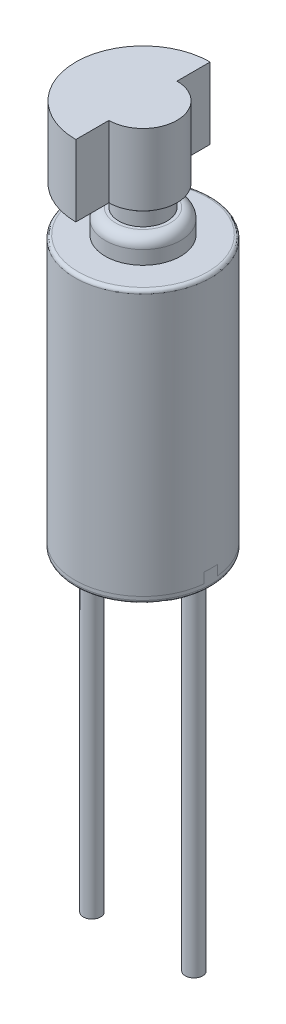
ISO-10303-21;
HEADER;
FILE_DESCRIPTION(('STEP AP214'),'2;1');
FILE_NAME('part.step','',(''),(''),'','','');
FILE_SCHEMA(('AUTOMOTIVE_DESIGN { 1 0 10303 214 1 1 1 1 }'));
ENDSEC;
DATA;
#1=APPLICATION_CONTEXT('core data for automotive mechanical design processes');
#2=APPLICATION_PROTOCOL_DEFINITION('international standard','automotive_design',2000,#1);
#3=PRODUCT_CONTEXT('',#1,'mechanical');
#4=PRODUCT('Part','Part','',(#3));
#5=PRODUCT_RELATED_PRODUCT_CATEGORY('part','',(#4));
#6=PRODUCT_DEFINITION_FORMATION('','',#4);
#7=PRODUCT_DEFINITION_CONTEXT('part definition',#1,'design');
#8=PRODUCT_DEFINITION('design','',#6,#7);
#9=PRODUCT_DEFINITION_SHAPE('','',#8);
#10=(LENGTH_UNIT() NAMED_UNIT(*) SI_UNIT(.MILLI.,.METRE.));
#11=(NAMED_UNIT(*) PLANE_ANGLE_UNIT() SI_UNIT($,.RADIAN.));
#12=(NAMED_UNIT(*) SI_UNIT($,.STERADIAN.) SOLID_ANGLE_UNIT());
#13=UNCERTAINTY_MEASURE_WITH_UNIT(LENGTH_MEASURE(1.E-05),#10,'distance_accuracy_value','');
#14=(GEOMETRIC_REPRESENTATION_CONTEXT(3) GLOBAL_UNCERTAINTY_ASSIGNED_CONTEXT((#13)) GLOBAL_UNIT_ASSIGNED_CONTEXT((#10,
#11,#12)) REPRESENTATION_CONTEXT('',''));
#15=CARTESIAN_POINT('',(0.,0.,0.));
#16=DIRECTION('',(0.,0.,1.));
#17=DIRECTION('',(1.,0.,0.));
#18=AXIS2_PLACEMENT_3D('',#15,#16,#17);
#19=CARTESIAN_POINT('',(1.5,-10.,0.));
#20=DIRECTION('',(0.,1.,0.));
#21=DIRECTION('',(0.,0.,1.));
#22=AXIS2_PLACEMENT_3D('',#19,#20,#21);
#23=CYLINDRICAL_SURFACE('',#22,0.255);
#24=CARTESIAN_POINT('',(1.5,-10.,0.));
#25=DIRECTION('',(0.,-1.,0.));
#26=DIRECTION('',(0.,0.,1.));
#27=AXIS2_PLACEMENT_3D('',#24,#25,#26);
#28=CIRCLE('',#27,0.255);
#29=CARTESIAN_POINT('',(1.5,-10.,0.255));
#30=VERTEX_POINT('',#29);
#31=EDGE_CURVE('E11',#30,#30,#28,.T.);
#32=ORIENTED_EDGE('',*,*,#31,.F.);
#33=EDGE_LOOP('',(#32));
#34=FACE_BOUND('',#33,.T.);
#35=CARTESIAN_POINT('',(1.5,0.,0.));
#36=DIRECTION('',(0.,-1.,0.));
#37=DIRECTION('',(0.,0.,1.));
#38=AXIS2_PLACEMENT_3D('',#35,#36,#37);
#39=CIRCLE('',#38,0.255);
#40=CARTESIAN_POINT('',(1.5,0.,0.255));
#41=VERTEX_POINT('',#40);
#42=EDGE_CURVE('E45',#41,#41,#39,.T.);
#43=ORIENTED_EDGE('',*,*,#42,.T.);
#44=EDGE_LOOP('',(#43));
#45=FACE_BOUND('',#44,.T.);
#46=ADVANCED_FACE('F42',(#34,#45),#23,.T.);
#47=CARTESIAN_POINT('',(1.5,-10.,0.));
#48=DIRECTION('',(0.,1.,0.));
#49=DIRECTION('',(0.,0.,1.));
#50=AXIS2_PLACEMENT_3D('',#47,#48,#49);
#51=PLANE('',#50);
#52=ORIENTED_EDGE('',*,*,#31,.T.);
#53=EDGE_LOOP('',(#52));
#54=FACE_BOUND('',#53,.T.);
#55=ADVANCED_FACE('F57',(#54),#51,.F.);
#56=CARTESIAN_POINT('',(1.5,0.,0.));
#57=DIRECTION('',(0.,1.,0.));
#58=DIRECTION('',(0.,0.,1.));
#59=AXIS2_PLACEMENT_3D('',#56,#57,#58);
#60=PLANE('',#59);
#61=ORIENTED_EDGE('',*,*,#42,.F.);
#62=EDGE_LOOP('',(#61));
#63=FACE_BOUND('',#62,.T.);
#64=ADVANCED_FACE('F55',(#63),#60,.T.);
#65=CLOSED_SHELL('',(#46,#55,#64));
#66=MANIFOLD_SOLID_BREP('B2',#65);
#67=CARTESIAN_POINT('',(-1.5,-10.,0.));
#68=DIRECTION('',(0.,1.,0.));
#69=DIRECTION('',(0.,0.,1.));
#70=AXIS2_PLACEMENT_3D('',#67,#68,#69);
#71=CYLINDRICAL_SURFACE('',#70,0.255);
#72=CARTESIAN_POINT('',(-1.5,-10.,0.));
#73=DIRECTION('',(0.,-1.,0.));
#74=DIRECTION('',(0.,0.,-1.));
#75=AXIS2_PLACEMENT_3D('',#72,#73,#74);
#76=CIRCLE('',#75,0.255);
#77=CARTESIAN_POINT('',(-1.5,-10.,-0.255));
#78=VERTEX_POINT('',#77);
#79=EDGE_CURVE('E41',#78,#78,#76,.T.);
#80=ORIENTED_EDGE('',*,*,#79,.F.);
#81=EDGE_LOOP('',(#80));
#82=FACE_BOUND('',#81,.T.);
#83=CARTESIAN_POINT('',(-1.5,0.,0.));
#84=DIRECTION('',(0.,-1.,0.));
#85=DIRECTION('',(0.,0.,-1.));
#86=AXIS2_PLACEMENT_3D('',#83,#84,#85);
#87=CIRCLE('',#86,0.255);
#88=CARTESIAN_POINT('',(-1.5,0.,-0.255));
#89=VERTEX_POINT('',#88);
#90=EDGE_CURVE('E108',#89,#89,#87,.T.);
#91=ORIENTED_EDGE('',*,*,#90,.T.);
#92=EDGE_LOOP('',(#91));
#93=FACE_BOUND('',#92,.T.);
#94=ADVANCED_FACE('F105',(#82,#93),#71,.T.);
#95=CARTESIAN_POINT('',(-1.5,-10.,0.));
#96=DIRECTION('',(0.,-1.,0.));
#97=DIRECTION('',(0.,0.,-1.));
#98=AXIS2_PLACEMENT_3D('',#95,#96,#97);
#99=PLANE('',#98);
#100=ORIENTED_EDGE('',*,*,#79,.T.);
#101=EDGE_LOOP('',(#100));
#102=FACE_BOUND('',#101,.T.);
#103=ADVANCED_FACE('F120',(#102),#99,.T.);
#104=CARTESIAN_POINT('',(-1.5,0.,0.));
#105=DIRECTION('',(0.,-1.,0.));
#106=DIRECTION('',(0.,0.,-1.));
#107=AXIS2_PLACEMENT_3D('',#104,#105,#106);
#108=PLANE('',#107);
#109=ORIENTED_EDGE('',*,*,#90,.F.);
#110=EDGE_LOOP('',(#109));
#111=FACE_BOUND('',#110,.T.);
#112=ADVANCED_FACE('F118',(#111),#108,.F.);
#113=CLOSED_SHELL('',(#94,#103,#112));
#114=MANIFOLD_SOLID_BREP('B6',#113);
#115=CARTESIAN_POINT('',(-2.01,0.2,-2.));
#116=DIRECTION('',(0.,1.,0.));
#117=DIRECTION('',(0.,0.,1.));
#118=AXIS2_PLACEMENT_3D('',#115,#116,#117);
#119=PLANE('',#118);
#120=DIRECTION('',(1.,0.,0.));
#121=VECTOR('',#120,1.);
#122=CARTESIAN_POINT('',(-2.01,0.2,-0.2));
#123=LINE('',#122,#121);
#124=CARTESIAN_POINT('',(-1.98997487421324,0.2,-0.2));
#125=VERTEX_POINT('',#124);
#126=CARTESIAN_POINT('',(1.98997487421324,0.2,-0.2));
#127=VERTEX_POINT('',#126);
#128=EDGE_CURVE('E183',#125,#127,#123,.T.);
#129=ORIENTED_EDGE('',*,*,#128,.T.);
#130=CARTESIAN_POINT('',(0.,0.2,0.));
#131=DIRECTION('',(0.,1.,0.));
#132=DIRECTION('',(0.,0.,1.));
#133=AXIS2_PLACEMENT_3D('',#130,#131,#132);
#134=CIRCLE('',#133,2.);
#135=EDGE_CURVE('E238',#127,#125,#134,.T.);
#136=ORIENTED_EDGE('',*,*,#135,.T.);
#137=EDGE_LOOP('',(#129,#136));
#138=FACE_BOUND('',#137,.T.);
#139=ADVANCED_FACE('F168',(#138),#119,.T.);
#140=CARTESIAN_POINT('',(-2.01,0.2,-0.2));
#141=DIRECTION('',(0.,0.,-1.));
#142=DIRECTION('',(0.,1.,0.));
#143=AXIS2_PLACEMENT_3D('',#140,#141,#142);
#144=PLANE('',#143);
#145=DIRECTION('',(1.,0.,0.));
#146=VECTOR('',#145,1.);
#147=CARTESIAN_POINT('',(-2.01,0.5,-0.2));
#148=LINE('',#147,#146);
#149=CARTESIAN_POINT('',(-1.98997487421324,0.5,-0.199999999999997));
#150=VERTEX_POINT('',#149);
#151=CARTESIAN_POINT('',(1.98997487421324,0.5,-0.199999999999997));
#152=VERTEX_POINT('',#151);
#153=EDGE_CURVE('E242',#150,#152,#148,.T.);
#154=ORIENTED_EDGE('',*,*,#153,.T.);
#155=DIRECTION('',(0.,-1.,0.));
#156=VECTOR('',#155,1.);
#157=CARTESIAN_POINT('',(1.98997487421324,8.,-0.199999999999997));
#158=LINE('',#157,#156);
#159=EDGE_CURVE('E234',#152,#127,#158,.T.);
#160=ORIENTED_EDGE('',*,*,#159,.T.);
#161=ORIENTED_EDGE('',*,*,#128,.F.);
#162=DIRECTION('',(0.,-1.,0.));
#163=VECTOR('',#162,1.);
#164=CARTESIAN_POINT('',(-1.98997487421324,8.,-0.199999999999997));
#165=LINE('',#164,#163);
#166=EDGE_CURVE('E236',#125,#150,#165,.F.);
#167=ORIENTED_EDGE('',*,*,#166,.T.);
#168=EDGE_LOOP('',(#154,#160,#161,#167));
#169=FACE_BOUND('',#168,.T.);
#170=ADVANCED_FACE('F250',(#169),#144,.T.);
#171=CARTESIAN_POINT('',(-2.01,0.5,0.2));
#172=DIRECTION('',(0.,1.,0.));
#173=DIRECTION('',(0.,0.,1.));
#174=AXIS2_PLACEMENT_3D('',#171,#172,#173);
#175=PLANE('',#174);
#176=DIRECTION('',(1.,0.,0.));
#177=VECTOR('',#176,1.);
#178=CARTESIAN_POINT('',(-2.01,0.5,0.2));
#179=LINE('',#178,#177);
#180=CARTESIAN_POINT('',(-1.98997487421324,0.5,0.2));
#181=VERTEX_POINT('',#180);
#182=CARTESIAN_POINT('',(1.98997487421324,0.5,0.2));
#183=VERTEX_POINT('',#182);
#184=EDGE_CURVE('E215',#181,#183,#179,.T.);
#185=ORIENTED_EDGE('',*,*,#184,.T.);
#186=CARTESIAN_POINT('',(0.,0.5,0.));
#187=DIRECTION('',(0.,1.,0.));
#188=DIRECTION('',(0.,0.,1.));
#189=AXIS2_PLACEMENT_3D('',#186,#187,#188);
#190=CIRCLE('',#189,2.);
#191=EDGE_CURVE('E231',#183,#152,#190,.T.);
#192=ORIENTED_EDGE('',*,*,#191,.T.);
#193=ORIENTED_EDGE('',*,*,#153,.F.);
#194=EDGE_CURVE('E232',#150,#181,#190,.T.);
#195=ORIENTED_EDGE('',*,*,#194,.T.);
#196=EDGE_LOOP('',(#185,#192,#193,#195));
#197=FACE_BOUND('',#196,.T.);
#198=ADVANCED_FACE('F247',(#197),#175,.T.);
#199=CARTESIAN_POINT('',(-2.01,0.2,0.2));
#200=DIRECTION('',(0.,0.,1.));
#201=DIRECTION('',(0.,-1.,0.));
#202=AXIS2_PLACEMENT_3D('',#199,#200,#201);
#203=PLANE('',#202);
#204=ORIENTED_EDGE('',*,*,#184,.F.);
#205=DIRECTION('',(0.,-1.,0.));
#206=VECTOR('',#205,1.);
#207=CARTESIAN_POINT('',(-1.98997487421324,8.,0.199999999999999));
#208=LINE('',#207,#206);
#209=CARTESIAN_POINT('',(-1.98997487421324,0.2,0.199999999999999));
#210=VERTEX_POINT('',#209);
#211=EDGE_CURVE('E218',#181,#210,#208,.T.);
#212=ORIENTED_EDGE('',*,*,#211,.T.);
#213=DIRECTION('',(1.,0.,0.));
#214=VECTOR('',#213,1.);
#215=CARTESIAN_POINT('',(-2.01,0.2,0.2));
#216=LINE('',#215,#214);
#217=CARTESIAN_POINT('',(1.98997487421324,0.2,0.199999999999999));
#218=VERTEX_POINT('',#217);
#219=EDGE_CURVE('E207',#210,#218,#216,.T.);
#220=ORIENTED_EDGE('',*,*,#219,.T.);
#221=DIRECTION('',(0.,-1.,0.));
#222=VECTOR('',#221,1.);
#223=CARTESIAN_POINT('',(1.98997487421324,8.,0.199999999999999));
#224=LINE('',#223,#222);
#225=EDGE_CURVE('E223',#218,#183,#224,.F.);
#226=ORIENTED_EDGE('',*,*,#225,.T.);
#227=EDGE_LOOP('',(#204,#212,#220,#226));
#228=FACE_BOUND('',#227,.T.);
#229=ADVANCED_FACE('F219',(#228),#203,.T.);
#230=CARTESIAN_POINT('',(-2.01,0.2,2.));
#231=DIRECTION('',(0.,1.,0.));
#232=DIRECTION('',(0.,0.,1.));
#233=AXIS2_PLACEMENT_3D('',#230,#231,#232);
#234=PLANE('',#233);
#235=CARTESIAN_POINT('',(0.,0.2,0.));
#236=DIRECTION('',(0.,1.,0.));
#237=DIRECTION('',(0.,0.,1.));
#238=AXIS2_PLACEMENT_3D('',#235,#236,#237);
#239=CIRCLE('',#238,2.);
#240=EDGE_CURVE('E211',#210,#218,#239,.T.);
#241=ORIENTED_EDGE('',*,*,#240,.T.);
#242=ORIENTED_EDGE('',*,*,#219,.F.);
#243=EDGE_LOOP('',(#241,#242));
#244=FACE_BOUND('',#243,.T.);
#245=ADVANCED_FACE('F209',(#244),#234,.T.);
#246=CARTESIAN_POINT('',(0.,8.,0.));
#247=DIRECTION('',(0.,-1.,0.));
#248=DIRECTION('',(0.,0.,-1.));
#249=AXIS2_PLACEMENT_3D('',#246,#247,#248);
#250=CYLINDRICAL_SURFACE('',#249,2.);
#251=CARTESIAN_POINT('',(0.,0.0999999999999994,0.));
#252=DIRECTION('',(0.,1.,0.));
#253=DIRECTION('',(0.,0.,1.));
#254=AXIS2_PLACEMENT_3D('',#251,#252,#253);
#255=CIRCLE('',#254,2.);
#256=CARTESIAN_POINT('',(0.,0.0999999999999994,2.));
#257=VERTEX_POINT('',#256);
#258=EDGE_CURVE('E176',#257,#257,#255,.T.);
#259=ORIENTED_EDGE('',*,*,#258,.T.);
#260=EDGE_LOOP('',(#259));
#261=FACE_BOUND('',#260,.T.);
#262=ORIENTED_EDGE('',*,*,#225,.F.);
#263=ORIENTED_EDGE('',*,*,#240,.F.);
#264=ORIENTED_EDGE('',*,*,#211,.F.);
#265=ORIENTED_EDGE('',*,*,#194,.F.);
#266=ORIENTED_EDGE('',*,*,#166,.F.);
#267=ORIENTED_EDGE('',*,*,#135,.F.);
#268=ORIENTED_EDGE('',*,*,#159,.F.);
#269=ORIENTED_EDGE('',*,*,#191,.F.);
#270=EDGE_LOOP('',(#262,#263,#264,#265,#266,#267,#268,#269));
#271=FACE_BOUND('',#270,.T.);
#272=ADVANCED_FACE('F225',(#261,#271),#250,.T.);
#273=CARTESIAN_POINT('',(0.,0.,0.));
#274=DIRECTION('',(0.,1.,0.));
#275=DIRECTION('',(0.,0.,1.));
#276=AXIS2_PLACEMENT_3D('',#273,#274,#275);
#277=PLANE('',#276);
#278=CARTESIAN_POINT('',(0.,0.,0.));
#279=DIRECTION('',(0.,1.,0.));
#280=DIRECTION('',(0.,0.,1.));
#281=AXIS2_PLACEMENT_3D('',#278,#279,#280);
#282=CIRCLE('',#281,1.9);
#283=CARTESIAN_POINT('',(0.,0.,1.9));
#284=VERTEX_POINT('',#283);
#285=EDGE_CURVE('E103',#284,#284,#282,.F.);
#286=ORIENTED_EDGE('',*,*,#285,.T.);
#287=EDGE_LOOP('',(#286));
#288=FACE_BOUND('',#287,.T.);
#289=ADVANCED_FACE('F260',(#288),#277,.F.);
#290=CARTESIAN_POINT('',(0.,0.0999999999999994,0.));
#291=DIRECTION('',(0.,1.,0.));
#292=DIRECTION('',(0.,0.,1.));
#293=AXIS2_PLACEMENT_3D('',#290,#291,#292);
#294=TOROIDAL_SURFACE('',#293,1.9,0.1);
#295=ORIENTED_EDGE('',*,*,#285,.F.);
#296=EDGE_LOOP('',(#295));
#297=FACE_BOUND('',#296,.T.);
#298=ORIENTED_EDGE('',*,*,#258,.F.);
#299=EDGE_LOOP('',(#298));
#300=FACE_BOUND('',#299,.T.);
#301=ADVANCED_FACE('F170',(#297,#300),#294,.T.);
#302=CLOSED_SHELL('',(#139,#170,#198,#229,#245,#272,#289,#301));
#303=MANIFOLD_SOLID_BREP('B36',#302);
#304=CARTESIAN_POINT('',(-2.01,0.2,-2.));
#305=DIRECTION('',(0.,1.,0.));
#306=DIRECTION('',(0.,0.,1.));
#307=AXIS2_PLACEMENT_3D('',#304,#305,#306);
#308=PLANE('',#307);
#309=DIRECTION('',(1.,0.,0.));
#310=VECTOR('',#309,1.);
#311=CARTESIAN_POINT('',(-2.01,0.2,-0.2));
#312=LINE('',#311,#310);
#313=CARTESIAN_POINT('',(-1.98997487421324,0.2,-0.2));
#314=VERTEX_POINT('',#313);
#315=CARTESIAN_POINT('',(1.98997487421324,0.2,-0.2));
#316=VERTEX_POINT('',#315);
#317=EDGE_CURVE('E391',#314,#316,#312,.T.);
#318=ORIENTED_EDGE('',*,*,#317,.F.);
#319=CARTESIAN_POINT('',(0.,0.2,0.));
#320=DIRECTION('',(0.,1.,0.));
#321=DIRECTION('',(0.,0.,1.));
#322=AXIS2_PLACEMENT_3D('',#319,#320,#321);
#323=CIRCLE('',#322,2.);
#324=EDGE_CURVE('E346',#316,#314,#323,.T.);
#325=ORIENTED_EDGE('',*,*,#324,.F.);
#326=EDGE_LOOP('',(#318,#325));
#327=FACE_BOUND('',#326,.T.);
#328=ADVANCED_FACE('F331',(#327),#308,.F.);
#329=CARTESIAN_POINT('',(-2.01,0.2,-0.2));
#330=DIRECTION('',(0.,0.,-1.));
#331=DIRECTION('',(0.,1.,0.));
#332=AXIS2_PLACEMENT_3D('',#329,#330,#331);
#333=PLANE('',#332);
#334=DIRECTION('',(1.,0.,0.));
#335=VECTOR('',#334,1.);
#336=CARTESIAN_POINT('',(-2.01,0.5,-0.2));
#337=LINE('',#336,#335);
#338=CARTESIAN_POINT('',(-1.98997487421324,0.5,-0.199999999999997));
#339=VERTEX_POINT('',#338);
#340=CARTESIAN_POINT('',(1.98997487421324,0.5,-0.199999999999997));
#341=VERTEX_POINT('',#340);
#342=EDGE_CURVE('E395',#339,#341,#337,.T.);
#343=ORIENTED_EDGE('',*,*,#342,.F.);
#344=DIRECTION('',(0.,-1.,0.));
#345=VECTOR('',#344,1.);
#346=CARTESIAN_POINT('',(-1.98997487421324,8.,-0.199999999999997));
#347=LINE('',#346,#345);
#348=EDGE_CURVE('E455',#314,#339,#347,.F.);
#349=ORIENTED_EDGE('',*,*,#348,.F.);
#350=ORIENTED_EDGE('',*,*,#317,.T.);
#351=DIRECTION('',(0.,-1.,0.));
#352=VECTOR('',#351,1.);
#353=CARTESIAN_POINT('',(1.98997487421324,8.,-0.199999999999997));
#354=LINE('',#353,#352);
#355=EDGE_CURVE('E459',#341,#316,#354,.T.);
#356=ORIENTED_EDGE('',*,*,#355,.F.);
#357=EDGE_LOOP('',(#343,#349,#350,#356));
#358=FACE_BOUND('',#357,.T.);
#359=ADVANCED_FACE('F417',(#358),#333,.F.);
#360=CARTESIAN_POINT('',(-2.01,0.5,0.2));
#361=DIRECTION('',(0.,1.,0.));
#362=DIRECTION('',(0.,0.,1.));
#363=AXIS2_PLACEMENT_3D('',#360,#361,#362);
#364=PLANE('',#363);
#365=DIRECTION('',(1.,0.,0.));
#366=VECTOR('',#365,1.);
#367=CARTESIAN_POINT('',(-2.01,0.5,0.2));
#368=LINE('',#367,#366);
#369=CARTESIAN_POINT('',(-1.98997487421324,0.5,0.2));
#370=VERTEX_POINT('',#369);
#371=CARTESIAN_POINT('',(1.98997487421324,0.5,0.2));
#372=VERTEX_POINT('',#371);
#373=EDGE_CURVE('E385',#370,#372,#368,.T.);
#374=ORIENTED_EDGE('',*,*,#373,.F.);
#375=CARTESIAN_POINT('',(0.,0.5,0.));
#376=DIRECTION('',(0.,1.,0.));
#377=DIRECTION('',(0.,0.,1.));
#378=AXIS2_PLACEMENT_3D('',#375,#376,#377);
#379=CIRCLE('',#378,2.);
#380=EDGE_CURVE('E375',#339,#370,#379,.T.);
#381=ORIENTED_EDGE('',*,*,#380,.F.);
#382=ORIENTED_EDGE('',*,*,#342,.T.);
#383=EDGE_CURVE('E461',#372,#341,#379,.T.);
#384=ORIENTED_EDGE('',*,*,#383,.F.);
#385=EDGE_LOOP('',(#374,#381,#382,#384));
#386=FACE_BOUND('',#385,.T.);
#387=ADVANCED_FACE('F422',(#386),#364,.F.);
#388=CARTESIAN_POINT('',(-2.01,0.2,0.2));
#389=DIRECTION('',(0.,0.,1.));
#390=DIRECTION('',(0.,-1.,0.));
#391=AXIS2_PLACEMENT_3D('',#388,#389,#390);
#392=PLANE('',#391);
#393=ORIENTED_EDGE('',*,*,#373,.T.);
#394=DIRECTION('',(0.,-1.,0.));
#395=VECTOR('',#394,1.);
#396=CARTESIAN_POINT('',(1.98997487421324,8.,0.199999999999999));
#397=LINE('',#396,#395);
#398=CARTESIAN_POINT('',(1.98997487421324,0.2,0.199999999999999));
#399=VERTEX_POINT('',#398);
#400=EDGE_CURVE('E379',#399,#372,#397,.F.);
#401=ORIENTED_EDGE('',*,*,#400,.F.);
#402=DIRECTION('',(1.,0.,0.));
#403=VECTOR('',#402,1.);
#404=CARTESIAN_POINT('',(-2.01,0.2,0.2));
#405=LINE('',#404,#403);
#406=CARTESIAN_POINT('',(-1.98997487421324,0.2,0.199999999999999));
#407=VERTEX_POINT('',#406);
#408=EDGE_CURVE('E382',#407,#399,#405,.T.);
#409=ORIENTED_EDGE('',*,*,#408,.F.);
#410=DIRECTION('',(0.,-1.,0.));
#411=VECTOR('',#410,1.);
#412=CARTESIAN_POINT('',(-1.98997487421324,8.,0.199999999999999));
#413=LINE('',#412,#411);
#414=EDGE_CURVE('E368',#370,#407,#413,.T.);
#415=ORIENTED_EDGE('',*,*,#414,.F.);
#416=EDGE_LOOP('',(#393,#401,#409,#415));
#417=FACE_BOUND('',#416,.T.);
#418=ADVANCED_FACE('F383',(#417),#392,.F.);
#419=CARTESIAN_POINT('',(-2.01,0.2,2.));
#420=DIRECTION('',(0.,1.,0.));
#421=DIRECTION('',(0.,0.,1.));
#422=AXIS2_PLACEMENT_3D('',#419,#420,#421);
#423=PLANE('',#422);
#424=CARTESIAN_POINT('',(0.,0.2,0.));
#425=DIRECTION('',(0.,1.,0.));
#426=DIRECTION('',(0.,0.,1.));
#427=AXIS2_PLACEMENT_3D('',#424,#425,#426);
#428=CIRCLE('',#427,2.);
#429=EDGE_CURVE('E373',#407,#399,#428,.T.);
#430=ORIENTED_EDGE('',*,*,#429,.F.);
#431=ORIENTED_EDGE('',*,*,#408,.T.);
#432=EDGE_LOOP('',(#430,#431));
#433=FACE_BOUND('',#432,.T.);
#434=ADVANCED_FACE('F387',(#433),#423,.F.);
#435=CARTESIAN_POINT('',(0.,8.7,0.));
#436=DIRECTION('',(0.,1.,0.));
#437=DIRECTION('',(0.,0.,1.));
#438=AXIS2_PLACEMENT_3D('',#435,#436,#437);
#439=PLANE('',#438);
#440=CARTESIAN_POINT('',(0.,8.7,0.));
#441=DIRECTION('',(0.,1.,0.));
#442=DIRECTION('',(0.,0.,1.));
#443=AXIS2_PLACEMENT_3D('',#440,#441,#442);
#444=CIRCLE('',#443,0.805);
#445=CARTESIAN_POINT('',(0.,8.7,0.805));
#446=VERTEX_POINT('',#445);
#447=EDGE_CURVE('E339',#446,#446,#444,.T.);
#448=ORIENTED_EDGE('',*,*,#447,.T.);
#449=EDGE_LOOP('',(#448));
#450=FACE_BOUND('',#449,.T.);
#451=ADVANCED_FACE('F406',(#450),#439,.T.);
#452=CARTESIAN_POINT('',(0.,8.7,0.));
#453=DIRECTION('',(0.,-1.,0.));
#454=DIRECTION('',(0.,0.,-1.));
#455=AXIS2_PLACEMENT_3D('',#452,#453,#454);
#456=CYLINDRICAL_SURFACE('',#455,1.105);
#457=CARTESIAN_POINT('',(0.,8.4,0.));
#458=DIRECTION('',(0.,1.,0.));
#459=DIRECTION('',(0.,0.,1.));
#460=AXIS2_PLACEMENT_3D('',#457,#458,#459);
#461=CIRCLE('',#460,1.105);
#462=CARTESIAN_POINT('',(0.,8.4,1.105));
#463=VERTEX_POINT('',#462);
#464=EDGE_CURVE('E166',#463,#463,#461,.F.);
#465=ORIENTED_EDGE('',*,*,#464,.T.);
#466=EDGE_LOOP('',(#465));
#467=FACE_BOUND('',#466,.T.);
#468=CARTESIAN_POINT('',(0.,8.,0.));
#469=DIRECTION('',(0.,1.,0.));
#470=DIRECTION('',(0.,0.,1.));
#471=AXIS2_PLACEMENT_3D('',#468,#469,#470);
#472=CIRCLE('',#471,1.105);
#473=CARTESIAN_POINT('',(0.,8.,1.105));
#474=VERTEX_POINT('',#473);
#475=EDGE_CURVE('E452',#474,#474,#472,.T.);
#476=ORIENTED_EDGE('',*,*,#475,.T.);
#477=EDGE_LOOP('',(#476));
#478=FACE_BOUND('',#477,.T.);
#479=ADVANCED_FACE('F437',(#467,#478),#456,.T.);
#480=CARTESIAN_POINT('',(0.,8.,0.));
#481=DIRECTION('',(0.,1.,0.));
#482=DIRECTION('',(0.,0.,1.));
#483=AXIS2_PLACEMENT_3D('',#480,#481,#482);
#484=PLANE('',#483);
#485=CARTESIAN_POINT('',(0.,8.,0.));
#486=DIRECTION('',(0.,1.,0.));
#487=DIRECTION('',(0.,0.,1.));
#488=AXIS2_PLACEMENT_3D('',#485,#486,#487);
#489=CIRCLE('',#488,1.9);
#490=CARTESIAN_POINT('',(0.,8.,1.9));
#491=VERTEX_POINT('',#490);
#492=EDGE_CURVE('E394',#491,#491,#489,.T.);
#493=ORIENTED_EDGE('',*,*,#492,.T.);
#494=EDGE_LOOP('',(#493));
#495=FACE_BOUND('',#494,.T.);
#496=ORIENTED_EDGE('',*,*,#475,.F.);
#497=EDGE_LOOP('',(#496));
#498=FACE_BOUND('',#497,.T.);
#499=ADVANCED_FACE('F440',(#495,#498),#484,.T.);
#500=CARTESIAN_POINT('',(0.,8.,0.));
#501=DIRECTION('',(0.,-1.,0.));
#502=DIRECTION('',(0.,0.,-1.));
#503=AXIS2_PLACEMENT_3D('',#500,#501,#502);
#504=CYLINDRICAL_SURFACE('',#503,2.);
#505=CARTESIAN_POINT('',(0.,7.9,0.));
#506=DIRECTION('',(0.,1.,0.));
#507=DIRECTION('',(0.,0.,1.));
#508=AXIS2_PLACEMENT_3D('',#505,#506,#507);
#509=CIRCLE('',#508,2.);
#510=CARTESIAN_POINT('',(0.,7.9,2.));
#511=VERTEX_POINT('',#510);
#512=EDGE_CURVE('E401',#511,#511,#509,.F.);
#513=ORIENTED_EDGE('',*,*,#512,.T.);
#514=EDGE_LOOP('',(#513));
#515=FACE_BOUND('',#514,.T.);
#516=ORIENTED_EDGE('',*,*,#429,.T.);
#517=ORIENTED_EDGE('',*,*,#400,.T.);
#518=ORIENTED_EDGE('',*,*,#383,.T.);
#519=ORIENTED_EDGE('',*,*,#355,.T.);
#520=ORIENTED_EDGE('',*,*,#324,.T.);
#521=ORIENTED_EDGE('',*,*,#348,.T.);
#522=ORIENTED_EDGE('',*,*,#380,.T.);
#523=ORIENTED_EDGE('',*,*,#414,.T.);
#524=EDGE_LOOP('',(#516,#517,#518,#519,#520,#521,#522,#523));
#525=FACE_BOUND('',#524,.T.);
#526=ADVANCED_FACE('F370',(#515,#525),#504,.T.);
#527=CARTESIAN_POINT('',(0.,7.9,0.));
#528=DIRECTION('',(0.,1.,0.));
#529=DIRECTION('',(0.,0.,1.));
#530=AXIS2_PLACEMENT_3D('',#527,#528,#529);
#531=TOROIDAL_SURFACE('',#530,1.9,0.1);
#532=ORIENTED_EDGE('',*,*,#512,.F.);
#533=EDGE_LOOP('',(#532));
#534=FACE_BOUND('',#533,.T.);
#535=ORIENTED_EDGE('',*,*,#492,.F.);
#536=EDGE_LOOP('',(#535));
#537=FACE_BOUND('',#536,.T.);
#538=ADVANCED_FACE('F409',(#534,#537),#531,.T.);
#539=CARTESIAN_POINT('',(0.,8.4,0.));
#540=DIRECTION('',(0.,1.,0.));
#541=DIRECTION('',(0.,0.,1.));
#542=AXIS2_PLACEMENT_3D('',#539,#540,#541);
#543=TOROIDAL_SURFACE('',#542,0.805,0.3);
#544=ORIENTED_EDGE('',*,*,#464,.F.);
#545=EDGE_LOOP('',(#544));
#546=FACE_BOUND('',#545,.T.);
#547=ORIENTED_EDGE('',*,*,#447,.F.);
#548=EDGE_LOOP('',(#547));
#549=FACE_BOUND('',#548,.T.);
#550=ADVANCED_FACE('F333',(#546,#549),#543,.T.);
#551=CLOSED_SHELL('',(#328,#359,#387,#418,#434,#451,#479,#499,#526,#538,#550));
#552=MANIFOLD_SOLID_BREP('B97',#551);
#553=CARTESIAN_POINT('',(0.,11.41,0.));
#554=DIRECTION('',(0.,-1.,0.));
#555=DIRECTION('',(0.,0.,-1.));
#556=AXIS2_PLACEMENT_3D('',#553,#554,#555);
#557=CYLINDRICAL_SURFACE('',#556,0.335);
#558=CARTESIAN_POINT('',(0.,9.3,0.));
#559=DIRECTION('',(0.,1.,0.));
#560=DIRECTION('',(0.,0.,1.));
#561=AXIS2_PLACEMENT_3D('',#558,#559,#560);
#562=CIRCLE('',#561,0.335);
#563=CARTESIAN_POINT('',(0.,9.3,0.335));
#564=VERTEX_POINT('',#563);
#565=EDGE_CURVE('E543',#564,#564,#562,.T.);
#566=ORIENTED_EDGE('',*,*,#565,.T.);
#567=EDGE_LOOP('',(#566));
#568=FACE_BOUND('',#567,.T.);
#569=CARTESIAN_POINT('',(0.,9.31,0.));
#570=DIRECTION('',(0.,1.,0.));
#571=DIRECTION('',(0.,0.,1.));
#572=AXIS2_PLACEMENT_3D('',#569,#570,#571);
#573=CIRCLE('',#572,0.335);
#574=CARTESIAN_POINT('',(0.,9.31,0.335));
#575=VERTEX_POINT('',#574);
#576=EDGE_CURVE('E329',#575,#575,#573,.T.);
#577=ORIENTED_EDGE('',*,*,#576,.F.);
#578=EDGE_LOOP('',(#577));
#579=FACE_BOUND('',#578,.T.);
#580=ADVANCED_FACE('F536',(#568,#579),#557,.T.);
#581=CARTESIAN_POINT('',(0.,9.3,0.));
#582=DIRECTION('',(0.,1.,0.));
#583=DIRECTION('',(0.,0.,1.));
#584=AXIS2_PLACEMENT_3D('',#581,#582,#583);
#585=PLANE('',#584);
#586=ORIENTED_EDGE('',*,*,#565,.F.);
#587=EDGE_LOOP('',(#586));
#588=FACE_BOUND('',#587,.T.);
#589=ADVANCED_FACE('F609',(#588),#585,.F.);
#590=CARTESIAN_POINT('',(0.,9.31,0.));
#591=DIRECTION('',(0.,1.,0.));
#592=DIRECTION('',(0.,0.,1.));
#593=AXIS2_PLACEMENT_3D('',#590,#591,#592);
#594=CYLINDRICAL_SURFACE('',#593,1.975);
#595=DIRECTION('',(0.,1.,0.));
#596=VECTOR('',#595,1.);
#597=CARTESIAN_POINT('',(0.,4.89376574443791,-1.975));
#598=LINE('',#597,#596);
#599=CARTESIAN_POINT('',(0.,9.31,-1.975));
#600=VERTEX_POINT('',#599);
#601=CARTESIAN_POINT('',(0.,11.41,-1.975));
#602=VERTEX_POINT('',#601);
#603=EDGE_CURVE('E594',#600,#602,#598,.T.);
#604=ORIENTED_EDGE('',*,*,#603,.F.);
#605=CARTESIAN_POINT('',(0.,9.31,0.));
#606=DIRECTION('',(0.,1.,0.));
#607=DIRECTION('',(0.,0.,1.));
#608=AXIS2_PLACEMENT_3D('',#605,#606,#607);
#609=CIRCLE('',#608,1.975);
#610=CARTESIAN_POINT('',(0.,9.31,1.975));
#611=VERTEX_POINT('',#610);
#612=EDGE_CURVE('E593',#600,#611,#609,.T.);
#613=ORIENTED_EDGE('',*,*,#612,.T.);
#614=DIRECTION('',(0.,1.,0.));
#615=VECTOR('',#614,1.);
#616=CARTESIAN_POINT('',(0.,4.89376574443791,1.975));
#617=LINE('',#616,#615);
#618=CARTESIAN_POINT('',(0.,11.41,1.975));
#619=VERTEX_POINT('',#618);
#620=EDGE_CURVE('E580',#611,#619,#617,.T.);
#621=ORIENTED_EDGE('',*,*,#620,.T.);
#622=CARTESIAN_POINT('',(0.,11.41,0.));
#623=DIRECTION('',(0.,1.,0.));
#624=DIRECTION('',(0.,0.,1.));
#625=AXIS2_PLACEMENT_3D('',#622,#623,#624);
#626=CIRCLE('',#625,1.975);
#627=EDGE_CURVE('E591',#602,#619,#626,.T.);
#628=ORIENTED_EDGE('',*,*,#627,.F.);
#629=EDGE_LOOP('',(#604,#613,#621,#628));
#630=FACE_BOUND('',#629,.T.);
#631=ADVANCED_FACE('F590',(#630),#594,.T.);
#632=CARTESIAN_POINT('',(0.,9.31,0.));
#633=DIRECTION('',(0.,1.,0.));
#634=DIRECTION('',(0.,0.,1.));
#635=AXIS2_PLACEMENT_3D('',#632,#633,#634);
#636=PLANE('',#635);
#637=ORIENTED_EDGE('',*,*,#576,.T.);
#638=EDGE_LOOP('',(#637));
#639=FACE_BOUND('',#638,.T.);
#640=ORIENTED_EDGE('',*,*,#612,.F.);
#641=DIRECTION('',(0.,0.,-1.));
#642=VECTOR('',#641,1.);
#643=CARTESIAN_POINT('',(0.,9.31,0.));
#644=LINE('',#643,#642);
#645=CARTESIAN_POINT('',(0.,9.31,-1.));
#646=VERTEX_POINT('',#645);
#647=EDGE_CURVE('E558',#646,#600,#644,.T.);
#648=ORIENTED_EDGE('',*,*,#647,.F.);
#649=CARTESIAN_POINT('',(0.,9.31,0.));
#650=DIRECTION('',(0.,1.,0.));
#651=DIRECTION('',(0.,0.,1.));
#652=AXIS2_PLACEMENT_3D('',#649,#650,#651);
#653=CIRCLE('',#652,1.);
#654=CARTESIAN_POINT('',(0.,9.31,1.));
#655=VERTEX_POINT('',#654);
#656=EDGE_CURVE('E602',#646,#655,#653,.F.);
#657=ORIENTED_EDGE('',*,*,#656,.T.);
#658=DIRECTION('',(0.,0.,-1.));
#659=VECTOR('',#658,1.);
#660=CARTESIAN_POINT('',(0.,9.31,0.));
#661=LINE('',#660,#659);
#662=EDGE_CURVE('E599',#611,#655,#661,.T.);
#663=ORIENTED_EDGE('',*,*,#662,.F.);
#664=EDGE_LOOP('',(#640,#648,#657,#663));
#665=FACE_BOUND('',#664,.T.);
#666=ADVANCED_FACE('F615',(#639,#665),#636,.F.);
#667=CARTESIAN_POINT('',(0.,11.41,0.));
#668=DIRECTION('',(0.,1.,0.));
#669=DIRECTION('',(0.,0.,1.));
#670=AXIS2_PLACEMENT_3D('',#667,#668,#669);
#671=PLANE('',#670);
#672=DIRECTION('',(0.,0.,1.));
#673=VECTOR('',#672,1.);
#674=CARTESIAN_POINT('',(0.,11.41,0.));
#675=LINE('',#674,#673);
#676=CARTESIAN_POINT('',(0.,11.41,-1.));
#677=VERTEX_POINT('',#676);
#678=EDGE_CURVE('E585',#602,#677,#675,.T.);
#679=ORIENTED_EDGE('',*,*,#678,.F.);
#680=ORIENTED_EDGE('',*,*,#627,.T.);
#681=CARTESIAN_POINT('',(0.,11.41,1.));
#682=VERTEX_POINT('',#681);
#683=EDGE_CURVE('E577',#682,#619,#675,.T.);
#684=ORIENTED_EDGE('',*,*,#683,.F.);
#685=CARTESIAN_POINT('',(0.,11.41,0.));
#686=DIRECTION('',(0.,1.,0.));
#687=DIRECTION('',(0.,0.,1.));
#688=AXIS2_PLACEMENT_3D('',#685,#686,#687);
#689=CIRCLE('',#688,1.);
#690=EDGE_CURVE('E550',#682,#677,#689,.T.);
#691=ORIENTED_EDGE('',*,*,#690,.T.);
#692=EDGE_LOOP('',(#679,#680,#684,#691));
#693=FACE_BOUND('',#692,.T.);
#694=ADVANCED_FACE('F597',(#693),#671,.T.);
#695=CARTESIAN_POINT('',(0.,4.89376574443791,0.));
#696=DIRECTION('',(0.,1.,0.));
#697=DIRECTION('',(0.,0.,1.));
#698=AXIS2_PLACEMENT_3D('',#695,#696,#697);
#699=CYLINDRICAL_SURFACE('',#698,1.);
#700=DIRECTION('',(0.,1.,0.));
#701=VECTOR('',#700,1.);
#702=CARTESIAN_POINT('',(0.,4.89376574443791,-1.));
#703=LINE('',#702,#701);
#704=EDGE_CURVE('E678',#646,#677,#703,.T.);
#705=ORIENTED_EDGE('',*,*,#704,.T.);
#706=ORIENTED_EDGE('',*,*,#690,.F.);
#707=DIRECTION('',(0.,1.,0.));
#708=VECTOR('',#707,1.);
#709=CARTESIAN_POINT('',(0.,4.89376574443791,1.));
#710=LINE('',#709,#708);
#711=EDGE_CURVE('E582',#655,#682,#710,.T.);
#712=ORIENTED_EDGE('',*,*,#711,.F.);
#713=ORIENTED_EDGE('',*,*,#656,.F.);
#714=EDGE_LOOP('',(#705,#706,#712,#713));
#715=FACE_BOUND('',#714,.T.);
#716=ADVANCED_FACE('F619',(#715),#699,.T.);
#717=CARTESIAN_POINT('',(0.,4.89376574443791,0.));
#718=DIRECTION('',(-1.,0.,0.));
#719=DIRECTION('',(0.,0.,1.));
#720=AXIS2_PLACEMENT_3D('',#717,#718,#719);
#721=PLANE('',#720);
#722=ORIENTED_EDGE('',*,*,#647,.T.);
#723=ORIENTED_EDGE('',*,*,#603,.T.);
#724=ORIENTED_EDGE('',*,*,#678,.T.);
#725=ORIENTED_EDGE('',*,*,#704,.F.);
#726=EDGE_LOOP('',(#722,#723,#724,#725));
#727=FACE_BOUND('',#726,.T.);
#728=ADVANCED_FACE('F626',(#727),#721,.F.);
#729=ORIENTED_EDGE('',*,*,#662,.T.);
#730=ORIENTED_EDGE('',*,*,#711,.T.);
#731=ORIENTED_EDGE('',*,*,#683,.T.);
#732=ORIENTED_EDGE('',*,*,#620,.F.);
#733=EDGE_LOOP('',(#729,#730,#731,#732));
#734=FACE_BOUND('',#733,.T.);
#735=ADVANCED_FACE('F579',(#734),#721,.F.);
#736=CLOSED_SHELL('',(#580,#589,#631,#666,#694,#716,#728,#735));
#737=MANIFOLD_SOLID_BREP('B160',#736);
#738=CARTESIAN_POINT('',(0.,9.3,0.));
#739=DIRECTION('',(0.,-1.,0.));
#740=DIRECTION('',(0.,0.,-1.));
#741=AXIS2_PLACEMENT_3D('',#738,#739,#740);
#742=CYLINDRICAL_SURFACE('',#741,0.71);
#743=CARTESIAN_POINT('',(0.,9.1,0.));
#744=DIRECTION('',(0.,1.,0.));
#745=DIRECTION('',(0.,0.,1.));
#746=AXIS2_PLACEMENT_3D('',#743,#744,#745);
#747=CIRCLE('',#746,0.71);
#748=CARTESIAN_POINT('',(0.,9.1,0.71));
#749=VERTEX_POINT('',#748);
#750=EDGE_CURVE('E535',#749,#749,#747,.F.);
#751=ORIENTED_EDGE('',*,*,#750,.T.);
#752=EDGE_LOOP('',(#751));
#753=FACE_BOUND('',#752,.T.);
#754=CARTESIAN_POINT('',(0.,8.7,0.));
#755=DIRECTION('',(0.,1.,0.));
#756=DIRECTION('',(0.,0.,1.));
#757=AXIS2_PLACEMENT_3D('',#754,#755,#756);
#758=CIRCLE('',#757,0.71);
#759=CARTESIAN_POINT('',(0.,8.7,0.71));
#760=VERTEX_POINT('',#759);
#761=EDGE_CURVE('E702',#760,#760,#758,.T.);
#762=ORIENTED_EDGE('',*,*,#761,.T.);
#763=EDGE_LOOP('',(#762));
#764=FACE_BOUND('',#763,.T.);
#765=ADVANCED_FACE('F691',(#753,#764),#742,.T.);
#766=CARTESIAN_POINT('',(0.,9.3,0.));
#767=DIRECTION('',(0.,1.,0.));
#768=DIRECTION('',(0.,0.,1.));
#769=AXIS2_PLACEMENT_3D('',#766,#767,#768);
#770=PLANE('',#769);
#771=CARTESIAN_POINT('',(0.,9.3,0.));
#772=DIRECTION('',(0.,1.,0.));
#773=DIRECTION('',(0.,0.,1.));
#774=AXIS2_PLACEMENT_3D('',#771,#772,#773);
#775=CIRCLE('',#774,0.509999999999999);
#776=CARTESIAN_POINT('',(0.,9.3,0.509999999999999));
#777=VERTEX_POINT('',#776);
#778=EDGE_CURVE('E698',#777,#777,#775,.T.);
#779=ORIENTED_EDGE('',*,*,#778,.T.);
#780=EDGE_LOOP('',(#779));
#781=FACE_BOUND('',#780,.T.);
#782=ADVANCED_FACE('F712',(#781),#770,.T.);
#783=CARTESIAN_POINT('',(0.,8.7,0.));
#784=DIRECTION('',(0.,1.,0.));
#785=DIRECTION('',(0.,0.,1.));
#786=AXIS2_PLACEMENT_3D('',#783,#784,#785);
#787=PLANE('',#786);
#788=ORIENTED_EDGE('',*,*,#761,.F.);
#789=EDGE_LOOP('',(#788));
#790=FACE_BOUND('',#789,.T.);
#791=ADVANCED_FACE('F710',(#790),#787,.F.);
#792=CARTESIAN_POINT('',(0.,9.3,0.));
#793=DIRECTION('',(0.,-1.,0.));
#794=DIRECTION('',(0.,0.,-1.));
#795=AXIS2_PLACEMENT_3D('',#792,#793,#794);
#796=CONICAL_SURFACE('',#795,0.509999999999999,0.785398163397445);
#797=ORIENTED_EDGE('',*,*,#750,.F.);
#798=EDGE_LOOP('',(#797));
#799=FACE_BOUND('',#798,.T.);
#800=ORIENTED_EDGE('',*,*,#778,.F.);
#801=EDGE_LOOP('',(#800));
#802=FACE_BOUND('',#801,.T.);
#803=ADVANCED_FACE('F693',(#799,#802),#796,.T.);
#804=CLOSED_SHELL('',(#765,#782,#791,#803));
#805=MANIFOLD_SOLID_BREP('B323',#804);
#806=ADVANCED_BREP_SHAPE_REPRESENTATION('',(#18,#66,#114,#303,#552,#737,#805),#14);
#807=SHAPE_DEFINITION_REPRESENTATION(#9,#806);
ENDSEC;
END-ISO-10303-21;
